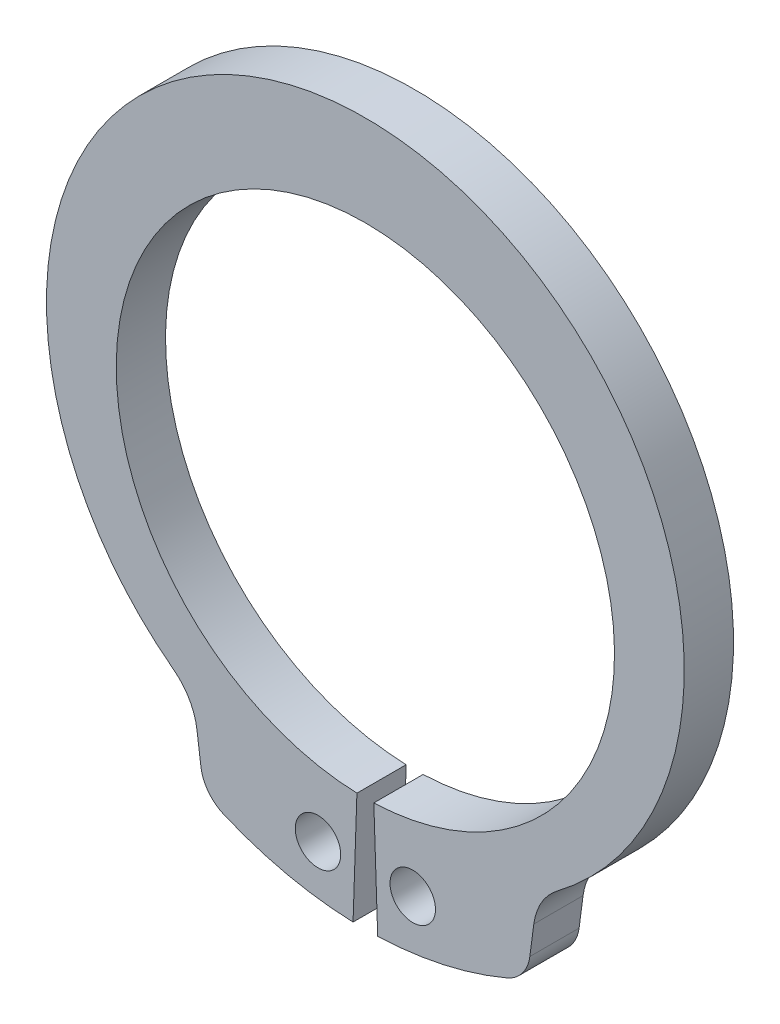
ISO-10303-21;
HEADER;
FILE_DESCRIPTION(('STEP AP214'),'2;1');
FILE_NAME('part.step','',(''),(''),'','','');
FILE_SCHEMA(('AUTOMOTIVE_DESIGN { 1 0 10303 214 1 1 1 1 }'));
ENDSEC;
DATA;
#1=APPLICATION_CONTEXT('core data for automotive mechanical design processes');
#2=APPLICATION_PROTOCOL_DEFINITION('international standard','automotive_design',2000,#1);
#3=PRODUCT_CONTEXT('',#1,'mechanical');
#4=PRODUCT('Part','Part','',(#3));
#5=PRODUCT_RELATED_PRODUCT_CATEGORY('part','',(#4));
#6=PRODUCT_DEFINITION_FORMATION('','',#4);
#7=PRODUCT_DEFINITION_CONTEXT('part definition',#1,'design');
#8=PRODUCT_DEFINITION('design','',#6,#7);
#9=PRODUCT_DEFINITION_SHAPE('','',#8);
#10=(LENGTH_UNIT() NAMED_UNIT(*) SI_UNIT(.MILLI.,.METRE.));
#11=(NAMED_UNIT(*) PLANE_ANGLE_UNIT() SI_UNIT($,.RADIAN.));
#12=(NAMED_UNIT(*) SI_UNIT($,.STERADIAN.) SOLID_ANGLE_UNIT());
#13=UNCERTAINTY_MEASURE_WITH_UNIT(LENGTH_MEASURE(1.E-05),#10,'distance_accuracy_value','');
#14=(GEOMETRIC_REPRESENTATION_CONTEXT(3) GLOBAL_UNCERTAINTY_ASSIGNED_CONTEXT((#13)) GLOBAL_UNIT_ASSIGNED_CONTEXT((#10,
#11,#12)) REPRESENTATION_CONTEXT('',''));
#15=CARTESIAN_POINT('',(0.,0.,0.));
#16=DIRECTION('',(0.,0.,1.));
#17=DIRECTION('',(1.,0.,0.));
#18=AXIS2_PLACEMENT_3D('',#15,#16,#17);
#19=CARTESIAN_POINT('',(0.,0.,-1.3));
#20=DIRECTION('',(0.,0.,1.));
#21=DIRECTION('',(1.,0.,0.));
#22=AXIS2_PLACEMENT_3D('',#19,#20,#21);
#23=CYLINDRICAL_SURFACE('',#22,6.575);
#24=CARTESIAN_POINT('',(0.,0.,0.));
#25=DIRECTION('',(0.,0.,-1.));
#26=DIRECTION('',(1.,0.,0.));
#27=AXIS2_PLACEMENT_3D('',#24,#25,#26);
#28=CIRCLE('',#27,6.575);
#29=CARTESIAN_POINT('',(-0.223172323759791,-6.57121138861836,0.));
#30=VERTEX_POINT('',#29);
#31=CARTESIAN_POINT('',(0.223172323759791,-6.57121138861836,0.));
#32=VERTEX_POINT('',#31);
#33=EDGE_CURVE('E121',#30,#32,#28,.T.);
#34=ORIENTED_EDGE('',*,*,#33,.F.);
#35=DIRECTION('',(0.,0.,1.));
#36=VECTOR('',#35,1.);
#37=CARTESIAN_POINT('',(-0.223172323759791,-6.57121138861836,-1.3));
#38=LINE('',#37,#36);
#39=CARTESIAN_POINT('',(-0.223172323759791,-6.57121138861836,-1.3));
#40=VERTEX_POINT('',#39);
#41=EDGE_CURVE('E11',#40,#30,#38,.T.);
#42=ORIENTED_EDGE('',*,*,#41,.F.);
#43=CARTESIAN_POINT('',(0.,0.,-1.3));
#44=DIRECTION('',(0.,0.,-1.));
#45=DIRECTION('',(1.,0.,0.));
#46=AXIS2_PLACEMENT_3D('',#43,#44,#45);
#47=CIRCLE('',#46,6.575);
#48=CARTESIAN_POINT('',(0.223172323759791,-6.57121138861836,-1.3));
#49=VERTEX_POINT('',#48);
#50=EDGE_CURVE('E123',#40,#49,#47,.T.);
#51=ORIENTED_EDGE('',*,*,#50,.T.);
#52=DIRECTION('',(0.,0.,1.));
#53=VECTOR('',#52,1.);
#54=CARTESIAN_POINT('',(0.223172323759791,-6.57121138861836,-1.3));
#55=LINE('',#54,#53);
#56=EDGE_CURVE('E36',#49,#32,#55,.T.);
#57=ORIENTED_EDGE('',*,*,#56,.T.);
#58=EDGE_LOOP('',(#34,#42,#51,#57));
#59=FACE_BOUND('',#58,.T.);
#60=ADVANCED_FACE('F33',(#59),#23,.F.);
#61=CARTESIAN_POINT('',(-0.223172323759791,-6.57121138861836,-1.3));
#62=DIRECTION('',(0.999423785341196,-0.0339425587467363,0.));
#63=DIRECTION('',(0.0339425587467363,0.999423785341196,0.));
#64=AXIS2_PLACEMENT_3D('',#61,#62,#63);
#65=PLANE('',#64);
#66=DIRECTION('',(0.0339425587467363,0.999423785341196,0.));
#67=VECTOR('',#66,1.);
#68=CARTESIAN_POINT('',(-0.223172323759791,-6.57121138861836,0.));
#69=LINE('',#68,#67);
#70=CARTESIAN_POINT('',(-0.325,-9.56948274464195,0.));
#71=VERTEX_POINT('',#70);
#72=EDGE_CURVE('E139',#71,#30,#69,.T.);
#73=ORIENTED_EDGE('',*,*,#72,.F.);
#74=DIRECTION('',(0.,0.,1.));
#75=VECTOR('',#74,1.);
#76=CARTESIAN_POINT('',(-0.325,-9.56948274464195,-1.3));
#77=LINE('',#76,#75);
#78=CARTESIAN_POINT('',(-0.325,-9.56948274464195,-1.3));
#79=VERTEX_POINT('',#78);
#80=EDGE_CURVE('E41',#79,#71,#77,.T.);
#81=ORIENTED_EDGE('',*,*,#80,.F.);
#82=DIRECTION('',(0.0339425587467363,0.999423785341196,0.));
#83=VECTOR('',#82,1.);
#84=CARTESIAN_POINT('',(-0.223172323759791,-6.57121138861836,-1.3));
#85=LINE('',#84,#83);
#86=EDGE_CURVE('E128',#79,#40,#85,.T.);
#87=ORIENTED_EDGE('',*,*,#86,.T.);
#88=ORIENTED_EDGE('',*,*,#41,.T.);
#89=EDGE_LOOP('',(#73,#81,#87,#88));
#90=FACE_BOUND('',#89,.T.);
#91=ADVANCED_FACE('F251',(#90),#65,.T.);
#92=CARTESIAN_POINT('',(0.,0.,-1.3));
#93=DIRECTION('',(0.,0.,1.));
#94=DIRECTION('',(1.,0.,0.));
#95=AXIS2_PLACEMENT_3D('',#92,#93,#94);
#96=CYLINDRICAL_SURFACE('',#95,9.575);
#97=CARTESIAN_POINT('',(0.,0.,0.));
#98=DIRECTION('',(0.,0.,1.));
#99=DIRECTION('',(1.,0.,0.));
#100=AXIS2_PLACEMENT_3D('',#97,#98,#99);
#101=CIRCLE('',#100,9.575);
#102=CARTESIAN_POINT('',(-3.73982815429808,-8.81443760975818,0.));
#103=VERTEX_POINT('',#102);
#104=EDGE_CURVE('E169',#103,#71,#101,.T.);
#105=ORIENTED_EDGE('',*,*,#104,.F.);
#106=DIRECTION('',(0.,0.,1.));
#107=VECTOR('',#106,1.);
#108=CARTESIAN_POINT('',(-3.73982815429808,-8.81443760975818,-1.3));
#109=LINE('',#108,#107);
#110=CARTESIAN_POINT('',(-3.73982815429808,-8.81443760975818,-1.3));
#111=VERTEX_POINT('',#110);
#112=EDGE_CURVE('E203',#111,#103,#109,.T.);
#113=ORIENTED_EDGE('',*,*,#112,.F.);
#114=CARTESIAN_POINT('',(0.,0.,-1.3));
#115=DIRECTION('',(0.,0.,1.));
#116=DIRECTION('',(1.,0.,0.));
#117=AXIS2_PLACEMENT_3D('',#114,#115,#116);
#118=CIRCLE('',#117,9.575);
#119=EDGE_CURVE('E199',#111,#79,#118,.T.);
#120=ORIENTED_EDGE('',*,*,#119,.T.);
#121=ORIENTED_EDGE('',*,*,#80,.T.);
#122=EDGE_LOOP('',(#105,#113,#120,#121));
#123=FACE_BOUND('',#122,.T.);
#124=ADVANCED_FACE('F256',(#123),#96,.T.);
#125=CARTESIAN_POINT('',(-3.34924557943666,-7.89386971317769,-1.3));
#126=DIRECTION('',(0.,0.,1.));
#127=DIRECTION('',(1.,0.,0.));
#128=AXIS2_PLACEMENT_3D('',#125,#126,#127);
#129=CYLINDRICAL_SURFACE('',#128,0.999999999999998);
#130=CARTESIAN_POINT('',(-3.34924557943666,-7.89386971317769,0.));
#131=DIRECTION('',(0.,0.,1.));
#132=DIRECTION('',(1.,0.,0.));
#133=AXIS2_PLACEMENT_3D('',#130,#131,#132);
#134=CIRCLE('',#133,0.999999999999998);
#135=CARTESIAN_POINT('',(-4.34069044081047,-8.02439590539774,0.));
#136=VERTEX_POINT('',#135);
#137=EDGE_CURVE('E166',#136,#103,#134,.T.);
#138=ORIENTED_EDGE('',*,*,#137,.F.);
#139=DIRECTION('',(0.,0.,1.));
#140=VECTOR('',#139,1.);
#141=CARTESIAN_POINT('',(-4.34069044081047,-8.02439590539774,-1.3));
#142=LINE('',#141,#140);
#143=CARTESIAN_POINT('',(-4.34069044081047,-8.02439590539774,-1.3));
#144=VERTEX_POINT('',#143);
#145=EDGE_CURVE('E205',#144,#136,#142,.T.);
#146=ORIENTED_EDGE('',*,*,#145,.F.);
#147=CARTESIAN_POINT('',(-3.34924557943666,-7.89386971317769,-1.3));
#148=DIRECTION('',(0.,0.,1.));
#149=DIRECTION('',(1.,0.,0.));
#150=AXIS2_PLACEMENT_3D('',#147,#148,#149);
#151=CIRCLE('',#150,0.999999999999998);
#152=EDGE_CURVE('E196',#144,#111,#151,.T.);
#153=ORIENTED_EDGE('',*,*,#152,.T.);
#154=ORIENTED_EDGE('',*,*,#112,.T.);
#155=EDGE_LOOP('',(#138,#146,#153,#154));
#156=FACE_BOUND('',#155,.T.);
#157=ADVANCED_FACE('F248',(#156),#129,.T.);
#158=CARTESIAN_POINT('',(-4.44546721938754,-7.2285372586029,-1.3));
#159=DIRECTION('',(-0.99144486137381,-0.130526192220054,0.));
#160=DIRECTION('',(0.130526192220054,-0.99144486137381,0.));
#161=AXIS2_PLACEMENT_3D('',#158,#159,#160);
#162=PLANE('',#161);
#163=DIRECTION('',(0.130526192220054,-0.99144486137381,0.));
#164=VECTOR('',#163,1.);
#165=CARTESIAN_POINT('',(-4.44546721938754,-7.2285372586029,0.));
#166=LINE('',#165,#164);
#167=CARTESIAN_POINT('',(-4.44546721938754,-7.2285372586029,0.));
#168=VERTEX_POINT('',#167);
#169=EDGE_CURVE('E163',#168,#136,#166,.T.);
#170=ORIENTED_EDGE('',*,*,#169,.F.);
#171=DIRECTION('',(0.,0.,1.));
#172=VECTOR('',#171,1.);
#173=CARTESIAN_POINT('',(-4.44546721938754,-7.2285372586029,-1.3));
#174=LINE('',#173,#172);
#175=CARTESIAN_POINT('',(-4.44546721938754,-7.2285372586029,-1.3));
#176=VERTEX_POINT('',#175);
#177=EDGE_CURVE('E207',#176,#168,#174,.T.);
#178=ORIENTED_EDGE('',*,*,#177,.F.);
#179=DIRECTION('',(0.130526192220054,-0.99144486137381,0.));
#180=VECTOR('',#179,1.);
#181=CARTESIAN_POINT('',(-4.44546721938754,-7.2285372586029,-1.3));
#182=LINE('',#181,#180);
#183=EDGE_CURVE('E193',#176,#144,#182,.T.);
#184=ORIENTED_EDGE('',*,*,#183,.T.);
#185=ORIENTED_EDGE('',*,*,#145,.T.);
#186=EDGE_LOOP('',(#170,#178,#184,#185));
#187=FACE_BOUND('',#186,.T.);
#188=ADVANCED_FACE('F244',(#187),#162,.T.);
#189=CARTESIAN_POINT('',(-6.03061345162259,-7.43722571911789,-1.3));
#190=DIRECTION('',(0.,0.,1.));
#191=DIRECTION('',(1.,0.,0.));
#192=AXIS2_PLACEMENT_3D('',#189,#190,#191);
#193=CYLINDRICAL_SURFACE('',#192,1.59882439658679);
#194=CARTESIAN_POINT('',(-6.03061345162259,-7.43722571911789,0.));
#195=DIRECTION('',(0.,0.,-1.));
#196=DIRECTION('',(1.,0.,0.));
#197=AXIS2_PLACEMENT_3D('',#194,#195,#196);
#198=CIRCLE('',#197,1.59882439658679);
#199=CARTESIAN_POINT('',(-5.06788143027927,-6.16075147096351,0.));
#200=VERTEX_POINT('',#199);
#201=EDGE_CURVE('E160',#200,#168,#198,.T.);
#202=ORIENTED_EDGE('',*,*,#201,.F.);
#203=DIRECTION('',(0.,0.,1.));
#204=VECTOR('',#203,1.);
#205=CARTESIAN_POINT('',(-5.06788143027927,-6.16075147096351,-1.3));
#206=LINE('',#205,#204);
#207=CARTESIAN_POINT('',(-5.06788143027927,-6.16075147096351,-1.3));
#208=VERTEX_POINT('',#207);
#209=EDGE_CURVE('E209',#208,#200,#206,.T.);
#210=ORIENTED_EDGE('',*,*,#209,.F.);
#211=CARTESIAN_POINT('',(-6.03061345162259,-7.43722571911789,-1.3));
#212=DIRECTION('',(0.,0.,-1.));
#213=DIRECTION('',(1.,0.,0.));
#214=AXIS2_PLACEMENT_3D('',#211,#212,#213);
#215=CIRCLE('',#214,1.59882439658679);
#216=EDGE_CURVE('E190',#208,#176,#215,.T.);
#217=ORIENTED_EDGE('',*,*,#216,.T.);
#218=ORIENTED_EDGE('',*,*,#177,.T.);
#219=EDGE_LOOP('',(#202,#210,#217,#218));
#220=FACE_BOUND('',#219,.T.);
#221=ADVANCED_FACE('F240',(#220),#193,.F.);
#222=CARTESIAN_POINT('',(0.,0.558688617281287,-1.3));
#223=DIRECTION('',(0.,0.,1.));
#224=DIRECTION('',(1.,0.,0.));
#225=AXIS2_PLACEMENT_3D('',#222,#223,#224);
#226=CYLINDRICAL_SURFACE('',#225,8.41631138271872);
#227=CARTESIAN_POINT('',(0.,0.558688617281287,0.));
#228=DIRECTION('',(0.,0.,1.));
#229=DIRECTION('',(1.,0.,0.));
#230=AXIS2_PLACEMENT_3D('',#227,#228,#229);
#231=CIRCLE('',#230,8.41631138271872);
#232=CARTESIAN_POINT('',(5.06788143027926,-6.16075147096351,0.));
#233=VERTEX_POINT('',#232);
#234=EDGE_CURVE('E157',#233,#200,#231,.T.);
#235=ORIENTED_EDGE('',*,*,#234,.F.);
#236=DIRECTION('',(0.,0.,1.));
#237=VECTOR('',#236,1.);
#238=CARTESIAN_POINT('',(5.06788143027926,-6.16075147096351,-1.3));
#239=LINE('',#238,#237);
#240=CARTESIAN_POINT('',(5.06788143027926,-6.16075147096351,-1.3));
#241=VERTEX_POINT('',#240);
#242=EDGE_CURVE('E211',#241,#233,#239,.T.);
#243=ORIENTED_EDGE('',*,*,#242,.F.);
#244=CARTESIAN_POINT('',(0.,0.558688617281287,-1.3));
#245=DIRECTION('',(0.,0.,1.));
#246=DIRECTION('',(1.,0.,0.));
#247=AXIS2_PLACEMENT_3D('',#244,#245,#246);
#248=CIRCLE('',#247,8.41631138271872);
#249=EDGE_CURVE('E187',#241,#208,#248,.T.);
#250=ORIENTED_EDGE('',*,*,#249,.T.);
#251=ORIENTED_EDGE('',*,*,#209,.T.);
#252=EDGE_LOOP('',(#235,#243,#250,#251));
#253=FACE_BOUND('',#252,.T.);
#254=ADVANCED_FACE('F236',(#253),#226,.T.);
#255=CARTESIAN_POINT('',(6.03061345162259,-7.43722571911789,-1.3));
#256=DIRECTION('',(0.,0.,1.));
#257=DIRECTION('',(1.,0.,0.));
#258=AXIS2_PLACEMENT_3D('',#255,#256,#257);
#259=CYLINDRICAL_SURFACE('',#258,1.59882439658679);
#260=CARTESIAN_POINT('',(6.03061345162259,-7.43722571911789,0.));
#261=DIRECTION('',(0.,0.,-1.));
#262=DIRECTION('',(1.,0.,0.));
#263=AXIS2_PLACEMENT_3D('',#260,#261,#262);
#264=CIRCLE('',#263,1.59882439658679);
#265=CARTESIAN_POINT('',(4.44546721938754,-7.2285372586029,0.));
#266=VERTEX_POINT('',#265);
#267=EDGE_CURVE('E154',#266,#233,#264,.T.);
#268=ORIENTED_EDGE('',*,*,#267,.F.);
#269=DIRECTION('',(0.,0.,1.));
#270=VECTOR('',#269,1.);
#271=CARTESIAN_POINT('',(4.44546721938754,-7.2285372586029,-1.3));
#272=LINE('',#271,#270);
#273=CARTESIAN_POINT('',(4.44546721938754,-7.2285372586029,-1.3));
#274=VERTEX_POINT('',#273);
#275=EDGE_CURVE('E213',#274,#266,#272,.T.);
#276=ORIENTED_EDGE('',*,*,#275,.F.);
#277=CARTESIAN_POINT('',(6.03061345162259,-7.43722571911789,-1.3));
#278=DIRECTION('',(0.,0.,-1.));
#279=DIRECTION('',(1.,0.,0.));
#280=AXIS2_PLACEMENT_3D('',#277,#278,#279);
#281=CIRCLE('',#280,1.59882439658679);
#282=EDGE_CURVE('E184',#274,#241,#281,.T.);
#283=ORIENTED_EDGE('',*,*,#282,.T.);
#284=ORIENTED_EDGE('',*,*,#242,.T.);
#285=EDGE_LOOP('',(#268,#276,#283,#284));
#286=FACE_BOUND('',#285,.T.);
#287=ADVANCED_FACE('F232',(#286),#259,.F.);
#288=CARTESIAN_POINT('',(4.44546721938754,-7.2285372586029,-1.3));
#289=DIRECTION('',(0.99144486137381,-0.130526192220054,0.));
#290=DIRECTION('',(0.130526192220054,0.99144486137381,0.));
#291=AXIS2_PLACEMENT_3D('',#288,#289,#290);
#292=PLANE('',#291);
#293=DIRECTION('',(0.130526192220054,0.99144486137381,0.));
#294=VECTOR('',#293,1.);
#295=CARTESIAN_POINT('',(4.44546721938754,-7.2285372586029,0.));
#296=LINE('',#295,#294);
#297=CARTESIAN_POINT('',(4.34069044081047,-8.02439590539774,0.));
#298=VERTEX_POINT('',#297);
#299=EDGE_CURVE('E151',#298,#266,#296,.T.);
#300=ORIENTED_EDGE('',*,*,#299,.F.);
#301=DIRECTION('',(0.,0.,1.));
#302=VECTOR('',#301,1.);
#303=CARTESIAN_POINT('',(4.34069044081047,-8.02439590539774,-1.3));
#304=LINE('',#303,#302);
#305=CARTESIAN_POINT('',(4.34069044081047,-8.02439590539774,-1.3));
#306=VERTEX_POINT('',#305);
#307=EDGE_CURVE('E215',#306,#298,#304,.T.);
#308=ORIENTED_EDGE('',*,*,#307,.F.);
#309=DIRECTION('',(0.130526192220054,0.99144486137381,0.));
#310=VECTOR('',#309,1.);
#311=CARTESIAN_POINT('',(4.44546721938754,-7.2285372586029,-1.3));
#312=LINE('',#311,#310);
#313=EDGE_CURVE('E181',#306,#274,#312,.T.);
#314=ORIENTED_EDGE('',*,*,#313,.T.);
#315=ORIENTED_EDGE('',*,*,#275,.T.);
#316=EDGE_LOOP('',(#300,#308,#314,#315));
#317=FACE_BOUND('',#316,.T.);
#318=ADVANCED_FACE('F228',(#317),#292,.T.);
#319=CARTESIAN_POINT('',(3.34924557943666,-7.89386971317769,-1.3));
#320=DIRECTION('',(0.,0.,1.));
#321=DIRECTION('',(1.,0.,0.));
#322=AXIS2_PLACEMENT_3D('',#319,#320,#321);
#323=CYLINDRICAL_SURFACE('',#322,0.999999999999998);
#324=CARTESIAN_POINT('',(3.34924557943666,-7.89386971317769,0.));
#325=DIRECTION('',(0.,0.,1.));
#326=DIRECTION('',(-1.,0.,0.));
#327=AXIS2_PLACEMENT_3D('',#324,#325,#326);
#328=CIRCLE('',#327,0.999999999999998);
#329=CARTESIAN_POINT('',(3.73982815429808,-8.81443760975817,0.));
#330=VERTEX_POINT('',#329);
#331=EDGE_CURVE('E148',#330,#298,#328,.T.);
#332=ORIENTED_EDGE('',*,*,#331,.F.);
#333=DIRECTION('',(0.,0.,1.));
#334=VECTOR('',#333,1.);
#335=CARTESIAN_POINT('',(3.73982815429808,-8.81443760975817,-1.3));
#336=LINE('',#335,#334);
#337=CARTESIAN_POINT('',(3.73982815429808,-8.81443760975817,-1.3));
#338=VERTEX_POINT('',#337);
#339=EDGE_CURVE('E217',#338,#330,#336,.T.);
#340=ORIENTED_EDGE('',*,*,#339,.F.);
#341=CARTESIAN_POINT('',(3.34924557943666,-7.89386971317769,-1.3));
#342=DIRECTION('',(0.,0.,1.));
#343=DIRECTION('',(-1.,0.,0.));
#344=AXIS2_PLACEMENT_3D('',#341,#342,#343);
#345=CIRCLE('',#344,0.999999999999998);
#346=EDGE_CURVE('E178',#338,#306,#345,.T.);
#347=ORIENTED_EDGE('',*,*,#346,.T.);
#348=ORIENTED_EDGE('',*,*,#307,.T.);
#349=EDGE_LOOP('',(#332,#340,#347,#348));
#350=FACE_BOUND('',#349,.T.);
#351=ADVANCED_FACE('F224',(#350),#323,.T.);
#352=CARTESIAN_POINT('',(0.,0.,-1.3));
#353=DIRECTION('',(0.,0.,1.));
#354=DIRECTION('',(1.,0.,0.));
#355=AXIS2_PLACEMENT_3D('',#352,#353,#354);
#356=CYLINDRICAL_SURFACE('',#355,9.575);
#357=CARTESIAN_POINT('',(0.,0.,0.));
#358=DIRECTION('',(0.,0.,1.));
#359=DIRECTION('',(1.,0.,0.));
#360=AXIS2_PLACEMENT_3D('',#357,#358,#359);
#361=CIRCLE('',#360,9.575);
#362=CARTESIAN_POINT('',(0.324999999999999,-9.56948274464195,0.));
#363=VERTEX_POINT('',#362);
#364=EDGE_CURVE('E135',#363,#330,#361,.T.);
#365=ORIENTED_EDGE('',*,*,#364,.F.);
#366=DIRECTION('',(0.,0.,1.));
#367=VECTOR('',#366,1.);
#368=CARTESIAN_POINT('',(0.324999999999999,-9.56948274464195,-1.3));
#369=LINE('',#368,#367);
#370=CARTESIAN_POINT('',(0.324999999999999,-9.56948274464195,-1.3));
#371=VERTEX_POINT('',#370);
#372=EDGE_CURVE('E127',#371,#363,#369,.T.);
#373=ORIENTED_EDGE('',*,*,#372,.F.);
#374=CARTESIAN_POINT('',(0.,0.,-1.3));
#375=DIRECTION('',(0.,0.,1.));
#376=DIRECTION('',(1.,0.,0.));
#377=AXIS2_PLACEMENT_3D('',#374,#375,#376);
#378=CIRCLE('',#377,9.575);
#379=EDGE_CURVE('E175',#371,#338,#378,.T.);
#380=ORIENTED_EDGE('',*,*,#379,.T.);
#381=ORIENTED_EDGE('',*,*,#339,.T.);
#382=EDGE_LOOP('',(#365,#373,#380,#381));
#383=FACE_BOUND('',#382,.T.);
#384=ADVANCED_FACE('F220',(#383),#356,.T.);
#385=CARTESIAN_POINT('',(0.223172323759791,-6.57121138861836,-1.3));
#386=DIRECTION('',(-0.999423785341196,-0.0339425587467363,0.));
#387=DIRECTION('',(0.0339425587467363,-0.999423785341196,0.));
#388=AXIS2_PLACEMENT_3D('',#385,#386,#387);
#389=PLANE('',#388);
#390=DIRECTION('',(0.0339425587467363,-0.999423785341196,0.));
#391=VECTOR('',#390,1.);
#392=CARTESIAN_POINT('',(0.223172323759791,-6.57121138861836,0.));
#393=LINE('',#392,#391);
#394=EDGE_CURVE('E130',#32,#363,#393,.T.);
#395=ORIENTED_EDGE('',*,*,#394,.F.);
#396=ORIENTED_EDGE('',*,*,#56,.F.);
#397=DIRECTION('',(0.0339425587467363,-0.999423785341196,0.));
#398=VECTOR('',#397,1.);
#399=CARTESIAN_POINT('',(0.223172323759791,-6.57121138861836,-1.3));
#400=LINE('',#399,#398);
#401=EDGE_CURVE('E173',#49,#371,#400,.T.);
#402=ORIENTED_EDGE('',*,*,#401,.T.);
#403=ORIENTED_EDGE('',*,*,#372,.T.);
#404=EDGE_LOOP('',(#395,#396,#402,#403));
#405=FACE_BOUND('',#404,.T.);
#406=ADVANCED_FACE('F131',(#405),#389,.T.);
#407=CARTESIAN_POINT('',(0.,0.,-1.3));
#408=DIRECTION('',(0.,0.,1.));
#409=DIRECTION('',(1.,0.,0.));
#410=AXIS2_PLACEMENT_3D('',#407,#408,#409);
#411=PLANE('',#410);
#412=CARTESIAN_POINT('',(-1.25,-8.19268919525207,-1.3));
#413=DIRECTION('',(0.,0.,1.));
#414=DIRECTION('',(1.,0.,0.));
#415=AXIS2_PLACEMENT_3D('',#412,#413,#414);
#416=CIRCLE('',#415,0.6);
#417=CARTESIAN_POINT('',(-0.65,-8.19268919525207,-1.3));
#418=VERTEX_POINT('',#417);
#419=EDGE_CURVE('E390',#418,#418,#416,.T.);
#420=ORIENTED_EDGE('',*,*,#419,.T.);
#421=EDGE_LOOP('',(#420));
#422=FACE_BOUND('',#421,.T.);
#423=CARTESIAN_POINT('',(1.25,-8.19268919525207,-1.3));
#424=DIRECTION('',(0.,0.,1.));
#425=DIRECTION('',(1.,0.,0.));
#426=AXIS2_PLACEMENT_3D('',#423,#424,#425);
#427=CIRCLE('',#426,0.6);
#428=CARTESIAN_POINT('',(1.85,-8.19268919525207,-1.3));
#429=VERTEX_POINT('',#428);
#430=EDGE_CURVE('E140',#429,#429,#427,.T.);
#431=ORIENTED_EDGE('',*,*,#430,.T.);
#432=EDGE_LOOP('',(#431));
#433=FACE_BOUND('',#432,.T.);
#434=ORIENTED_EDGE('',*,*,#50,.F.);
#435=ORIENTED_EDGE('',*,*,#86,.F.);
#436=ORIENTED_EDGE('',*,*,#119,.F.);
#437=ORIENTED_EDGE('',*,*,#152,.F.);
#438=ORIENTED_EDGE('',*,*,#183,.F.);
#439=ORIENTED_EDGE('',*,*,#216,.F.);
#440=ORIENTED_EDGE('',*,*,#249,.F.);
#441=ORIENTED_EDGE('',*,*,#282,.F.);
#442=ORIENTED_EDGE('',*,*,#313,.F.);
#443=ORIENTED_EDGE('',*,*,#346,.F.);
#444=ORIENTED_EDGE('',*,*,#379,.F.);
#445=ORIENTED_EDGE('',*,*,#401,.F.);
#446=EDGE_LOOP('',(#434,#435,#436,#437,#438,#439,#440,#441,#442,#443,#444,#445));
#447=FACE_BOUND('',#446,.T.);
#448=ADVANCED_FACE('F255',(#422,#433,#447),#411,.F.);
#449=CARTESIAN_POINT('',(0.,0.,0.));
#450=DIRECTION('',(0.,0.,1.));
#451=DIRECTION('',(1.,0.,0.));
#452=AXIS2_PLACEMENT_3D('',#449,#450,#451);
#453=PLANE('',#452);
#454=CARTESIAN_POINT('',(-1.25,-8.19268919525207,0.));
#455=DIRECTION('',(0.,0.,1.));
#456=DIRECTION('',(1.,0.,0.));
#457=AXIS2_PLACEMENT_3D('',#454,#455,#456);
#458=CIRCLE('',#457,0.6);
#459=CARTESIAN_POINT('',(-0.65,-8.19268919525207,0.));
#460=VERTEX_POINT('',#459);
#461=EDGE_CURVE('E393',#460,#460,#458,.T.);
#462=ORIENTED_EDGE('',*,*,#461,.F.);
#463=EDGE_LOOP('',(#462));
#464=FACE_BOUND('',#463,.T.);
#465=CARTESIAN_POINT('',(1.25,-8.19268919525207,0.));
#466=DIRECTION('',(0.,0.,1.));
#467=DIRECTION('',(1.,0.,0.));
#468=AXIS2_PLACEMENT_3D('',#465,#466,#467);
#469=CIRCLE('',#468,0.6);
#470=CARTESIAN_POINT('',(1.85,-8.19268919525207,0.));
#471=VERTEX_POINT('',#470);
#472=EDGE_CURVE('E143',#471,#471,#469,.T.);
#473=ORIENTED_EDGE('',*,*,#472,.F.);
#474=EDGE_LOOP('',(#473));
#475=FACE_BOUND('',#474,.T.);
#476=ORIENTED_EDGE('',*,*,#33,.T.);
#477=ORIENTED_EDGE('',*,*,#394,.T.);
#478=ORIENTED_EDGE('',*,*,#364,.T.);
#479=ORIENTED_EDGE('',*,*,#331,.T.);
#480=ORIENTED_EDGE('',*,*,#299,.T.);
#481=ORIENTED_EDGE('',*,*,#267,.T.);
#482=ORIENTED_EDGE('',*,*,#234,.T.);
#483=ORIENTED_EDGE('',*,*,#201,.T.);
#484=ORIENTED_EDGE('',*,*,#169,.T.);
#485=ORIENTED_EDGE('',*,*,#137,.T.);
#486=ORIENTED_EDGE('',*,*,#104,.T.);
#487=ORIENTED_EDGE('',*,*,#72,.T.);
#488=EDGE_LOOP('',(#476,#477,#478,#479,#480,#481,#482,#483,#484,#485,#486,#487));
#489=FACE_BOUND('',#488,.T.);
#490=ADVANCED_FACE('F137',(#464,#475,#489),#453,.T.);
#491=CARTESIAN_POINT('',(1.25,-8.19268919525207,-1.3));
#492=DIRECTION('',(0.,0.,1.));
#493=DIRECTION('',(1.,0.,0.));
#494=AXIS2_PLACEMENT_3D('',#491,#492,#493);
#495=CYLINDRICAL_SURFACE('',#494,0.6);
#496=ORIENTED_EDGE('',*,*,#430,.F.);
#497=EDGE_LOOP('',(#496));
#498=FACE_BOUND('',#497,.T.);
#499=ORIENTED_EDGE('',*,*,#472,.T.);
#500=EDGE_LOOP('',(#499));
#501=FACE_BOUND('',#500,.T.);
#502=ADVANCED_FACE('F363',(#498,#501),#495,.F.);
#503=CARTESIAN_POINT('',(-1.25,-8.19268919525207,-1.3));
#504=DIRECTION('',(0.,0.,1.));
#505=DIRECTION('',(1.,0.,0.));
#506=AXIS2_PLACEMENT_3D('',#503,#504,#505);
#507=CYLINDRICAL_SURFACE('',#506,0.6);
#508=ORIENTED_EDGE('',*,*,#419,.F.);
#509=EDGE_LOOP('',(#508));
#510=FACE_BOUND('',#509,.T.);
#511=ORIENTED_EDGE('',*,*,#461,.T.);
#512=EDGE_LOOP('',(#511));
#513=FACE_BOUND('',#512,.T.);
#514=ADVANCED_FACE('F373',(#510,#513),#507,.F.);
#515=CLOSED_SHELL('',(#60,#91,#124,#157,#188,#221,#254,#287,#318,#351,#384,#406,#448,#490,#502,#514));
#516=MANIFOLD_SOLID_BREP('B2',#515);
#517=ADVANCED_BREP_SHAPE_REPRESENTATION('',(#18,#516),#14);
#518=SHAPE_DEFINITION_REPRESENTATION(#9,#517);
ENDSEC;
END-ISO-10303-21;
